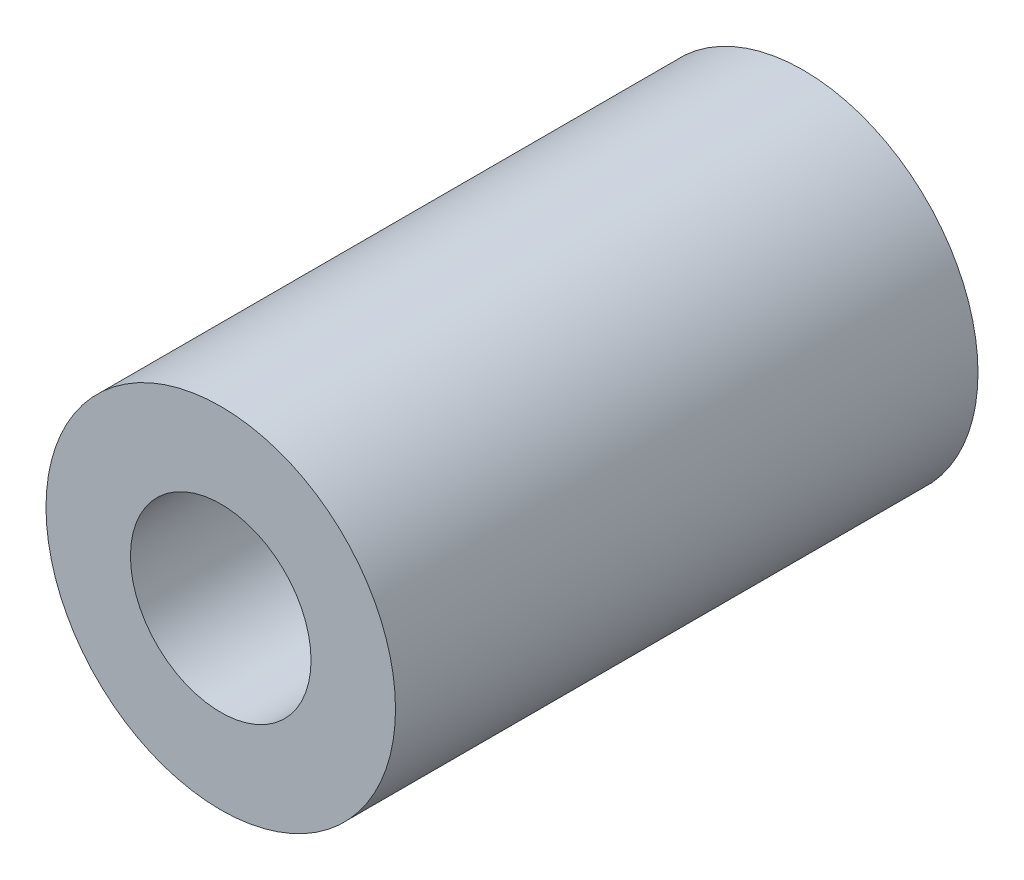
ISO-10303-21;
HEADER;
FILE_DESCRIPTION(('STEP AP214'),'2;1');
FILE_NAME('part.step','',(''),(''),'','','');
FILE_SCHEMA(('AUTOMOTIVE_DESIGN { 1 0 10303 214 1 1 1 1 }'));
ENDSEC;
DATA;
#1=APPLICATION_CONTEXT('core data for automotive mechanical design processes');
#2=APPLICATION_PROTOCOL_DEFINITION('international standard','automotive_design',2000,#1);
#3=PRODUCT_CONTEXT('',#1,'mechanical');
#4=PRODUCT('Part','Part','',(#3));
#5=PRODUCT_RELATED_PRODUCT_CATEGORY('part','',(#4));
#6=PRODUCT_DEFINITION_FORMATION('','',#4);
#7=PRODUCT_DEFINITION_CONTEXT('part definition',#1,'design');
#8=PRODUCT_DEFINITION('design','',#6,#7);
#9=PRODUCT_DEFINITION_SHAPE('','',#8);
#10=(LENGTH_UNIT() NAMED_UNIT(*) SI_UNIT(.MILLI.,.METRE.));
#11=(NAMED_UNIT(*) PLANE_ANGLE_UNIT() SI_UNIT($,.RADIAN.));
#12=(NAMED_UNIT(*) SI_UNIT($,.STERADIAN.) SOLID_ANGLE_UNIT());
#13=UNCERTAINTY_MEASURE_WITH_UNIT(LENGTH_MEASURE(1.E-05),#10,'distance_accuracy_value','');
#14=(GEOMETRIC_REPRESENTATION_CONTEXT(3) GLOBAL_UNCERTAINTY_ASSIGNED_CONTEXT((#13)) GLOBAL_UNIT_ASSIGNED_CONTEXT((#10,
#11,#12)) REPRESENTATION_CONTEXT('',''));
#15=CARTESIAN_POINT('',(0.,0.,0.));
#16=DIRECTION('',(0.,0.,1.));
#17=DIRECTION('',(1.,0.,0.));
#18=AXIS2_PLACEMENT_3D('',#15,#16,#17);
#19=CARTESIAN_POINT('',(0.,0.,10.));
#20=DIRECTION('',(0.,0.,1.));
#21=DIRECTION('',(1.,0.,0.));
#22=AXIS2_PLACEMENT_3D('',#19,#20,#21);
#23=PLANE('',#22);
#24=CARTESIAN_POINT('',(0.,0.,10.));
#25=DIRECTION('',(0.,0.,1.));
#26=DIRECTION('',(1.,0.,0.));
#27=AXIS2_PLACEMENT_3D('',#24,#25,#26);
#28=CIRCLE('',#27,3.);
#29=CARTESIAN_POINT('',(3.,0.,10.));
#30=VERTEX_POINT('',#29);
#31=EDGE_CURVE('E10',#30,#30,#28,.T.);
#32=ORIENTED_EDGE('',*,*,#31,.T.);
#33=EDGE_LOOP('',(#32));
#34=FACE_BOUND('',#33,.T.);
#35=CARTESIAN_POINT('',(0.,0.,10.));
#36=DIRECTION('',(0.,0.,1.));
#37=DIRECTION('',(1.,0.,0.));
#38=AXIS2_PLACEMENT_3D('',#35,#36,#37);
#39=CIRCLE('',#38,1.55);
#40=CARTESIAN_POINT('',(1.55,0.,10.));
#41=VERTEX_POINT('',#40);
#42=EDGE_CURVE('E44',#41,#41,#39,.T.);
#43=ORIENTED_EDGE('',*,*,#42,.F.);
#44=EDGE_LOOP('',(#43));
#45=FACE_BOUND('',#44,.T.);
#46=ADVANCED_FACE('F33',(#34,#45),#23,.T.);
#47=CARTESIAN_POINT('',(0.,0.,0.));
#48=DIRECTION('',(0.,0.,1.));
#49=DIRECTION('',(1.,0.,0.));
#50=AXIS2_PLACEMENT_3D('',#47,#48,#49);
#51=PLANE('',#50);
#52=CARTESIAN_POINT('',(0.,0.,0.));
#53=DIRECTION('',(0.,0.,1.));
#54=DIRECTION('',(1.,0.,0.));
#55=AXIS2_PLACEMENT_3D('',#52,#53,#54);
#56=CIRCLE('',#55,3.);
#57=CARTESIAN_POINT('',(3.,0.,0.));
#58=VERTEX_POINT('',#57);
#59=EDGE_CURVE('E37',#58,#58,#56,.T.);
#60=ORIENTED_EDGE('',*,*,#59,.F.);
#61=EDGE_LOOP('',(#60));
#62=FACE_BOUND('',#61,.T.);
#63=CARTESIAN_POINT('',(0.,0.,0.));
#64=DIRECTION('',(0.,0.,1.));
#65=DIRECTION('',(1.,0.,0.));
#66=AXIS2_PLACEMENT_3D('',#63,#64,#65);
#67=CIRCLE('',#66,1.55);
#68=CARTESIAN_POINT('',(1.55,0.,0.));
#69=VERTEX_POINT('',#68);
#70=EDGE_CURVE('E46',#69,#69,#67,.T.);
#71=ORIENTED_EDGE('',*,*,#70,.T.);
#72=EDGE_LOOP('',(#71));
#73=FACE_BOUND('',#72,.T.);
#74=ADVANCED_FACE('F56',(#62,#73),#51,.F.);
#75=CARTESIAN_POINT('',(0.,0.,10.));
#76=DIRECTION('',(0.,0.,-1.));
#77=DIRECTION('',(-1.,0.,0.));
#78=AXIS2_PLACEMENT_3D('',#75,#76,#77);
#79=CYLINDRICAL_SURFACE('',#78,3.);
#80=ORIENTED_EDGE('',*,*,#31,.F.);
#81=EDGE_LOOP('',(#80));
#82=FACE_BOUND('',#81,.T.);
#83=ORIENTED_EDGE('',*,*,#59,.T.);
#84=EDGE_LOOP('',(#83));
#85=FACE_BOUND('',#84,.T.);
#86=ADVANCED_FACE('F35',(#82,#85),#79,.T.);
#87=CARTESIAN_POINT('',(0.,0.,10.));
#88=DIRECTION('',(0.,0.,-1.));
#89=DIRECTION('',(-1.,0.,0.));
#90=AXIS2_PLACEMENT_3D('',#87,#88,#89);
#91=CYLINDRICAL_SURFACE('',#90,1.55);
#92=ORIENTED_EDGE('',*,*,#42,.T.);
#93=EDGE_LOOP('',(#92));
#94=FACE_BOUND('',#93,.T.);
#95=ORIENTED_EDGE('',*,*,#70,.F.);
#96=EDGE_LOOP('',(#95));
#97=FACE_BOUND('',#96,.T.);
#98=ADVANCED_FACE('F52',(#94,#97),#91,.F.);
#99=CLOSED_SHELL('',(#46,#74,#86,#98));
#100=MANIFOLD_SOLID_BREP('B2',#99);
#101=ADVANCED_BREP_SHAPE_REPRESENTATION('',(#18,#100),#14);
#102=SHAPE_DEFINITION_REPRESENTATION(#9,#101);
ENDSEC;
END-ISO-10303-21;
